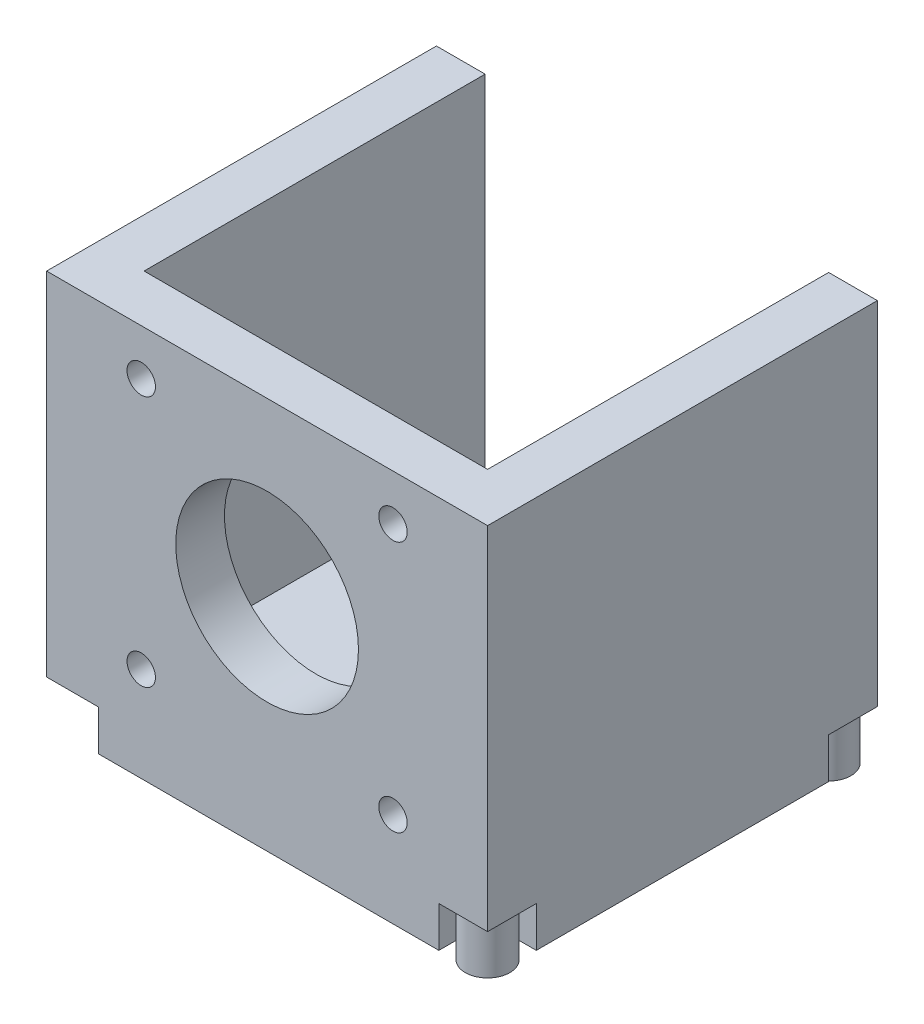
ISO-10303-21;
HEADER;
FILE_DESCRIPTION(('STEP AP214'),'2;1');
FILE_NAME('part.step','',(''),(''),'','','');
FILE_SCHEMA(('AUTOMOTIVE_DESIGN { 1 0 10303 214 1 1 1 1 }'));
ENDSEC;
DATA;
#1=APPLICATION_CONTEXT('core data for automotive mechanical design processes');
#2=APPLICATION_PROTOCOL_DEFINITION('international standard','automotive_design',2000,#1);
#3=PRODUCT_CONTEXT('',#1,'mechanical');
#4=PRODUCT('Part','Part','',(#3));
#5=PRODUCT_RELATED_PRODUCT_CATEGORY('part','',(#4));
#6=PRODUCT_DEFINITION_FORMATION('','',#4);
#7=PRODUCT_DEFINITION_CONTEXT('part definition',#1,'design');
#8=PRODUCT_DEFINITION('design','',#6,#7);
#9=PRODUCT_DEFINITION_SHAPE('','',#8);
#10=(LENGTH_UNIT() NAMED_UNIT(*) SI_UNIT(.MILLI.,.METRE.));
#11=(NAMED_UNIT(*) PLANE_ANGLE_UNIT() SI_UNIT($,.RADIAN.));
#12=(NAMED_UNIT(*) SI_UNIT($,.STERADIAN.) SOLID_ANGLE_UNIT());
#13=UNCERTAINTY_MEASURE_WITH_UNIT(LENGTH_MEASURE(1.E-05),#10,'distance_accuracy_value','');
#14=(GEOMETRIC_REPRESENTATION_CONTEXT(3) GLOBAL_UNCERTAINTY_ASSIGNED_CONTEXT((#13)) GLOBAL_UNIT_ASSIGNED_CONTEXT((#10,
#11,#12)) REPRESENTATION_CONTEXT('',''));
#15=CARTESIAN_POINT('',(0.,0.,0.));
#16=DIRECTION('',(0.,0.,1.));
#17=DIRECTION('',(1.,0.,0.));
#18=AXIS2_PLACEMENT_3D('',#15,#16,#17);
#19=CARTESIAN_POINT('',(0.,-1.,0.));
#20=DIRECTION('',(0.,-1.,0.));
#21=DIRECTION('',(0.,0.,-1.));
#22=AXIS2_PLACEMENT_3D('',#19,#20,#21);
#23=PLANE('',#22);
#24=DIRECTION('',(1.,0.,0.));
#25=VECTOR('',#24,1.);
#26=CARTESIAN_POINT('',(0.,-1.,-36.));
#27=LINE('',#26,#25);
#28=CARTESIAN_POINT('',(42.3,-1.,-36.));
#29=VERTEX_POINT('',#28);
#30=CARTESIAN_POINT('',(48.3,-1.,-36.));
#31=VERTEX_POINT('',#30);
#32=EDGE_CURVE('E255',#29,#31,#27,.T.);
#33=ORIENTED_EDGE('',*,*,#32,.F.);
#34=DIRECTION('',(0.,0.,1.));
#35=VECTOR('',#34,1.);
#36=CARTESIAN_POINT('',(42.3,-1.,0.));
#37=LINE('',#36,#35);
#38=CARTESIAN_POINT('',(42.3,-1.,-42.));
#39=VERTEX_POINT('',#38);
#40=EDGE_CURVE('E257',#39,#29,#37,.T.);
#41=ORIENTED_EDGE('',*,*,#40,.F.);
#42=DIRECTION('',(1.,0.,0.));
#43=VECTOR('',#42,1.);
#44=CARTESIAN_POINT('',(0.,-1.,-42.));
#45=LINE('',#44,#43);
#46=CARTESIAN_POINT('',(48.3,-1.,-42.));
#47=VERTEX_POINT('',#46);
#48=EDGE_CURVE('E260',#39,#47,#45,.T.);
#49=ORIENTED_EDGE('',*,*,#48,.T.);
#50=DIRECTION('',(0.,0.,1.));
#51=VECTOR('',#50,1.);
#52=CARTESIAN_POINT('',(48.3,-1.,0.));
#53=LINE('',#52,#51);
#54=EDGE_CURVE('E262',#47,#31,#53,.T.);
#55=ORIENTED_EDGE('',*,*,#54,.T.);
#56=EDGE_LOOP('',(#33,#41,#49,#55));
#57=FACE_BOUND('',#56,.T.);
#58=CARTESIAN_POINT('',(45.3,-1.,-39.));
#59=DIRECTION('',(0.,-1.,0.));
#60=DIRECTION('',(0.,0.,-1.));
#61=AXIS2_PLACEMENT_3D('',#58,#59,#60);
#62=CIRCLE('',#61,2.75);
#63=CARTESIAN_POINT('',(45.3,-1.,-41.75));
#64=VERTEX_POINT('',#63);
#65=EDGE_CURVE('E444',#64,#64,#62,.T.);
#66=ORIENTED_EDGE('',*,*,#65,.F.);
#67=EDGE_LOOP('',(#66));
#68=FACE_BOUND('',#67,.T.);
#69=ADVANCED_FACE('F35',(#57,#68),#23,.T.);
#70=CARTESIAN_POINT('',(0.,-1.,0.));
#71=DIRECTION('',(0.,-1.,0.));
#72=DIRECTION('',(0.,0.,-1.));
#73=AXIS2_PLACEMENT_3D('',#70,#71,#72);
#74=PLANE('',#73);
#75=DIRECTION('',(0.,0.,1.));
#76=VECTOR('',#75,1.);
#77=CARTESIAN_POINT('',(42.3,-1.,0.));
#78=LINE('',#77,#76);
#79=CARTESIAN_POINT('',(42.3,-1.,0.));
#80=VERTEX_POINT('',#79);
#81=CARTESIAN_POINT('',(42.3,-1.,6.));
#82=VERTEX_POINT('',#81);
#83=EDGE_CURVE('E184',#80,#82,#78,.T.);
#84=ORIENTED_EDGE('',*,*,#83,.F.);
#85=DIRECTION('',(-1.,0.,0.));
#86=VECTOR('',#85,1.);
#87=CARTESIAN_POINT('',(0.,-1.,0.));
#88=LINE('',#87,#86);
#89=CARTESIAN_POINT('',(48.3,-1.,0.));
#90=VERTEX_POINT('',#89);
#91=EDGE_CURVE('E176',#90,#80,#88,.T.);
#92=ORIENTED_EDGE('',*,*,#91,.F.);
#93=DIRECTION('',(0.,0.,1.));
#94=VECTOR('',#93,1.);
#95=CARTESIAN_POINT('',(48.3,-1.,0.));
#96=LINE('',#95,#94);
#97=CARTESIAN_POINT('',(48.3,-1.,6.));
#98=VERTEX_POINT('',#97);
#99=EDGE_CURVE('E52',#90,#98,#96,.T.);
#100=ORIENTED_EDGE('',*,*,#99,.T.);
#101=DIRECTION('',(-1.,0.,0.));
#102=VECTOR('',#101,1.);
#103=CARTESIAN_POINT('',(0.,-1.,6.));
#104=LINE('',#103,#102);
#105=EDGE_CURVE('E191',#98,#82,#104,.T.);
#106=ORIENTED_EDGE('',*,*,#105,.T.);
#107=EDGE_LOOP('',(#84,#92,#100,#106));
#108=FACE_BOUND('',#107,.T.);
#109=CARTESIAN_POINT('',(45.3,-1.,3.));
#110=DIRECTION('',(0.,-1.,0.));
#111=DIRECTION('',(0.,0.,-1.));
#112=AXIS2_PLACEMENT_3D('',#109,#110,#111);
#113=CIRCLE('',#112,2.75);
#114=CARTESIAN_POINT('',(45.3,-1.,0.249999999999999));
#115=VERTEX_POINT('',#114);
#116=EDGE_CURVE('E200',#115,#115,#113,.T.);
#117=ORIENTED_EDGE('',*,*,#116,.F.);
#118=EDGE_LOOP('',(#117));
#119=FACE_BOUND('',#118,.T.);
#120=ADVANCED_FACE('F193',(#108,#119),#74,.T.);
#121=CARTESIAN_POINT('',(48.3,0.,0.));
#122=DIRECTION('',(-1.,0.,0.));
#123=DIRECTION('',(0.,0.,1.));
#124=AXIS2_PLACEMENT_3D('',#121,#122,#123);
#125=PLANE('',#124);
#126=DIRECTION('',(0.,-1.,0.));
#127=VECTOR('',#126,1.);
#128=CARTESIAN_POINT('',(48.3,-1.,0.));
#129=LINE('',#128,#127);
#130=CARTESIAN_POINT('',(48.3,-6.,0.));
#131=VERTEX_POINT('',#130);
#132=EDGE_CURVE('E182',#90,#131,#129,.T.);
#133=ORIENTED_EDGE('',*,*,#132,.T.);
#134=DIRECTION('',(0.,0.,1.));
#135=VECTOR('',#134,1.);
#136=CARTESIAN_POINT('',(48.3,-6.,-42.));
#137=LINE('',#136,#135);
#138=CARTESIAN_POINT('',(48.3,-6.,-36.));
#139=VERTEX_POINT('',#138);
#140=EDGE_CURVE('E282',#139,#131,#137,.T.);
#141=ORIENTED_EDGE('',*,*,#140,.F.);
#142=DIRECTION('',(0.,-1.,0.));
#143=VECTOR('',#142,1.);
#144=CARTESIAN_POINT('',(48.3,-1.,-36.));
#145=LINE('',#144,#143);
#146=EDGE_CURVE('E270',#31,#139,#145,.T.);
#147=ORIENTED_EDGE('',*,*,#146,.F.);
#148=ORIENTED_EDGE('',*,*,#54,.F.);
#149=DIRECTION('',(0.,1.,0.));
#150=VECTOR('',#149,1.);
#151=CARTESIAN_POINT('',(48.3,42.3,-42.));
#152=LINE('',#151,#150);
#153=CARTESIAN_POINT('',(48.3,42.3,-42.));
#154=VERTEX_POINT('',#153);
#155=EDGE_CURVE('E295',#47,#154,#152,.T.);
#156=ORIENTED_EDGE('',*,*,#155,.T.);
#157=DIRECTION('',(0.,0.,1.));
#158=VECTOR('',#157,1.);
#159=CARTESIAN_POINT('',(48.3,42.3,6.));
#160=LINE('',#159,#158);
#161=CARTESIAN_POINT('',(48.3,42.3,6.));
#162=VERTEX_POINT('',#161);
#163=EDGE_CURVE('E298',#154,#162,#160,.T.);
#164=ORIENTED_EDGE('',*,*,#163,.T.);
#165=DIRECTION('',(0.,-1.,0.));
#166=VECTOR('',#165,1.);
#167=CARTESIAN_POINT('',(48.3,0.,6.));
#168=LINE('',#167,#166);
#169=EDGE_CURVE('E292',#162,#98,#168,.T.);
#170=ORIENTED_EDGE('',*,*,#169,.T.);
#171=ORIENTED_EDGE('',*,*,#99,.F.);
#172=EDGE_LOOP('',(#133,#141,#147,#148,#156,#164,#170,#171));
#173=FACE_BOUND('',#172,.T.);
#174=ADVANCED_FACE('F418',(#173),#125,.F.);
#175=CARTESIAN_POINT('',(0.,-6.,0.));
#176=DIRECTION('',(0.,-1.,0.));
#177=DIRECTION('',(0.,0.,-1.));
#178=AXIS2_PLACEMENT_3D('',#175,#176,#177);
#179=PLANE('',#178);
#180=DIRECTION('',(-1.,0.,0.));
#181=VECTOR('',#180,1.);
#182=CARTESIAN_POINT('',(0.,-6.,0.));
#183=LINE('',#182,#181);
#184=CARTESIAN_POINT('',(42.3,-6.,0.));
#185=VERTEX_POINT('',#184);
#186=EDGE_CURVE('E196',#131,#185,#183,.T.);
#187=ORIENTED_EDGE('',*,*,#186,.T.);
#188=DIRECTION('',(0.,0.,1.));
#189=VECTOR('',#188,1.);
#190=CARTESIAN_POINT('',(42.3,-6.,0.));
#191=LINE('',#190,#189);
#192=CARTESIAN_POINT('',(42.3,-6.,6.));
#193=VERTEX_POINT('',#192);
#194=EDGE_CURVE('E189',#185,#193,#191,.T.);
#195=ORIENTED_EDGE('',*,*,#194,.T.);
#196=DIRECTION('',(-1.,0.,0.));
#197=VECTOR('',#196,1.);
#198=CARTESIAN_POINT('',(48.3,-6.,6.));
#199=LINE('',#198,#197);
#200=CARTESIAN_POINT('',(0.359997753687231,-6.,6.));
#201=VERTEX_POINT('',#200);
#202=EDGE_CURVE('E285',#193,#201,#199,.T.);
#203=ORIENTED_EDGE('',*,*,#202,.T.);
#204=DIRECTION('',(0.,0.,1.));
#205=VECTOR('',#204,1.);
#206=CARTESIAN_POINT('',(0.359997753687231,-6.,0.));
#207=LINE('',#206,#205);
#208=CARTESIAN_POINT('',(0.359997753687231,-6.,0.));
#209=VERTEX_POINT('',#208);
#210=EDGE_CURVE('E215',#209,#201,#207,.T.);
#211=ORIENTED_EDGE('',*,*,#210,.F.);
#212=DIRECTION('',(1.,0.,0.));
#213=VECTOR('',#212,1.);
#214=CARTESIAN_POINT('',(0.,-6.,0.));
#215=LINE('',#214,#213);
#216=CARTESIAN_POINT('',(-6.,-6.,0.));
#217=VERTEX_POINT('',#216);
#218=EDGE_CURVE('E209',#217,#209,#215,.T.);
#219=ORIENTED_EDGE('',*,*,#218,.F.);
#220=DIRECTION('',(0.,0.,-1.));
#221=VECTOR('',#220,1.);
#222=CARTESIAN_POINT('',(-6.,-6.,6.));
#223=LINE('',#222,#221);
#224=CARTESIAN_POINT('',(-6.,-6.,-36.));
#225=VERTEX_POINT('',#224);
#226=EDGE_CURVE('E278',#217,#225,#223,.T.);
#227=ORIENTED_EDGE('',*,*,#226,.T.);
#228=DIRECTION('',(-1.,0.,0.));
#229=VECTOR('',#228,1.);
#230=CARTESIAN_POINT('',(0.,-6.,-36.));
#231=LINE('',#230,#229);
#232=CARTESIAN_POINT('',(0.,-6.,-36.));
#233=VERTEX_POINT('',#232);
#234=EDGE_CURVE('E236',#233,#225,#231,.T.);
#235=ORIENTED_EDGE('',*,*,#234,.F.);
#236=DIRECTION('',(0.,0.,1.));
#237=VECTOR('',#236,1.);
#238=CARTESIAN_POINT('',(0.,-6.,0.));
#239=LINE('',#238,#237);
#240=CARTESIAN_POINT('',(0.,-6.,-42.));
#241=VERTEX_POINT('',#240);
#242=EDGE_CURVE('E227',#241,#233,#239,.T.);
#243=ORIENTED_EDGE('',*,*,#242,.F.);
#244=DIRECTION('',(1.,0.,0.));
#245=VECTOR('',#244,1.);
#246=CARTESIAN_POINT('',(-6.,-6.,-42.));
#247=LINE('',#246,#245);
#248=CARTESIAN_POINT('',(42.3,-6.,-42.));
#249=VERTEX_POINT('',#248);
#250=EDGE_CURVE('E280',#241,#249,#247,.T.);
#251=ORIENTED_EDGE('',*,*,#250,.T.);
#252=DIRECTION('',(0.,0.,1.));
#253=VECTOR('',#252,1.);
#254=CARTESIAN_POINT('',(42.3,-6.,0.));
#255=LINE('',#254,#253);
#256=CARTESIAN_POINT('',(42.3,-6.,-36.));
#257=VERTEX_POINT('',#256);
#258=EDGE_CURVE('E258',#249,#257,#255,.T.);
#259=ORIENTED_EDGE('',*,*,#258,.T.);
#260=DIRECTION('',(1.,0.,0.));
#261=VECTOR('',#260,1.);
#262=CARTESIAN_POINT('',(0.,-6.,-36.));
#263=LINE('',#262,#261);
#264=EDGE_CURVE('E250',#257,#139,#263,.T.);
#265=ORIENTED_EDGE('',*,*,#264,.T.);
#266=ORIENTED_EDGE('',*,*,#140,.T.);
#267=EDGE_LOOP('',(#187,#195,#203,#211,#219,#227,#235,#243,#251,#259,#265,#266));
#268=FACE_BOUND('',#267,.T.);
#269=ADVANCED_FACE('F424',(#268),#179,.T.);
#270=CARTESIAN_POINT('',(0.,0.,6.));
#271=DIRECTION('',(0.,0.,-1.));
#272=DIRECTION('',(-1.,0.,0.));
#273=AXIS2_PLACEMENT_3D('',#270,#271,#272);
#274=PLANE('',#273);
#275=CARTESIAN_POINT('',(36.6500000000003,5.65,6.));
#276=DIRECTION('',(0.,0.,1.));
#277=DIRECTION('',(1.,0.,0.));
#278=AXIS2_PLACEMENT_3D('',#275,#276,#277);
#279=CIRCLE('',#278,1.75);
#280=CARTESIAN_POINT('',(38.4000000000003,5.65,6.));
#281=VERTEX_POINT('',#280);
#282=EDGE_CURVE('E329',#281,#281,#279,.T.);
#283=ORIENTED_EDGE('',*,*,#282,.F.);
#284=EDGE_LOOP('',(#283));
#285=FACE_BOUND('',#284,.T.);
#286=CARTESIAN_POINT('',(5.65,36.6499999999998,6.));
#287=DIRECTION('',(0.,0.,1.));
#288=DIRECTION('',(1.,0.,0.));
#289=AXIS2_PLACEMENT_3D('',#286,#287,#288);
#290=CIRCLE('',#289,1.75);
#291=CARTESIAN_POINT('',(7.40000000000001,36.6499999999998,6.));
#292=VERTEX_POINT('',#291);
#293=EDGE_CURVE('E342',#292,#292,#290,.T.);
#294=ORIENTED_EDGE('',*,*,#293,.F.);
#295=EDGE_LOOP('',(#294));
#296=FACE_BOUND('',#295,.T.);
#297=CARTESIAN_POINT('',(36.65,36.65,6.));
#298=DIRECTION('',(0.,0.,1.));
#299=DIRECTION('',(1.,0.,0.));
#300=AXIS2_PLACEMENT_3D('',#297,#298,#299);
#301=CIRCLE('',#300,1.75);
#302=CARTESIAN_POINT('',(38.4,36.65,6.));
#303=VERTEX_POINT('',#302);
#304=EDGE_CURVE('E354',#303,#303,#301,.T.);
#305=ORIENTED_EDGE('',*,*,#304,.F.);
#306=EDGE_LOOP('',(#305));
#307=FACE_BOUND('',#306,.T.);
#308=CARTESIAN_POINT('',(21.15,21.15,6.));
#309=DIRECTION('',(0.,0.,1.));
#310=DIRECTION('',(1.,0.,0.));
#311=AXIS2_PLACEMENT_3D('',#308,#309,#310);
#312=CIRCLE('',#311,11.25);
#313=CARTESIAN_POINT('',(32.4,21.15,6.));
#314=VERTEX_POINT('',#313);
#315=EDGE_CURVE('E348',#314,#314,#312,.T.);
#316=ORIENTED_EDGE('',*,*,#315,.F.);
#317=EDGE_LOOP('',(#316));
#318=FACE_BOUND('',#317,.T.);
#319=CARTESIAN_POINT('',(5.65000000000033,5.64999999999979,6.));
#320=DIRECTION('',(0.,0.,1.));
#321=DIRECTION('',(1.,0.,0.));
#322=AXIS2_PLACEMENT_3D('',#319,#320,#321);
#323=CIRCLE('',#322,1.75);
#324=CARTESIAN_POINT('',(7.40000000000033,5.64999999999979,6.));
#325=VERTEX_POINT('',#324);
#326=EDGE_CURVE('E336',#325,#325,#323,.T.);
#327=ORIENTED_EDGE('',*,*,#326,.F.);
#328=EDGE_LOOP('',(#327));
#329=FACE_BOUND('',#328,.T.);
#330=DIRECTION('',(0.,-1.,0.));
#331=VECTOR('',#330,1.);
#332=CARTESIAN_POINT('',(42.3,-1.,6.));
#333=LINE('',#332,#331);
#334=EDGE_CURVE('E207',#82,#193,#333,.T.);
#335=ORIENTED_EDGE('',*,*,#334,.F.);
#336=ORIENTED_EDGE('',*,*,#105,.F.);
#337=ORIENTED_EDGE('',*,*,#169,.F.);
#338=DIRECTION('',(-1.,0.,0.));
#339=VECTOR('',#338,1.);
#340=CARTESIAN_POINT('',(42.3,42.3,6.));
#341=LINE('',#340,#339);
#342=CARTESIAN_POINT('',(-6.,42.3,6.));
#343=VERTEX_POINT('',#342);
#344=EDGE_CURVE('E11',#162,#343,#341,.T.);
#345=ORIENTED_EDGE('',*,*,#344,.T.);
#346=DIRECTION('',(0.,1.,0.));
#347=VECTOR('',#346,1.);
#348=CARTESIAN_POINT('',(-6.,0.,6.));
#349=LINE('',#348,#347);
#350=CARTESIAN_POINT('',(-6.,-1.,6.));
#351=VERTEX_POINT('',#350);
#352=EDGE_CURVE('E311',#351,#343,#349,.T.);
#353=ORIENTED_EDGE('',*,*,#352,.F.);
#354=DIRECTION('',(-1.,0.,0.));
#355=VECTOR('',#354,1.);
#356=CARTESIAN_POINT('',(0.,-1.,6.));
#357=LINE('',#356,#355);
#358=CARTESIAN_POINT('',(0.359997753687231,-1.,6.));
#359=VERTEX_POINT('',#358);
#360=EDGE_CURVE('E60',#359,#351,#357,.T.);
#361=ORIENTED_EDGE('',*,*,#360,.F.);
#362=DIRECTION('',(0.,-1.,0.));
#363=VECTOR('',#362,1.);
#364=CARTESIAN_POINT('',(0.359997753687231,-1.,6.));
#365=LINE('',#364,#363);
#366=EDGE_CURVE('E228',#359,#201,#365,.T.);
#367=ORIENTED_EDGE('',*,*,#366,.T.);
#368=ORIENTED_EDGE('',*,*,#202,.F.);
#369=EDGE_LOOP('',(#335,#336,#337,#345,#353,#361,#367,#368));
#370=FACE_BOUND('',#369,.T.);
#371=ADVANCED_FACE('F421',(#285,#296,#307,#318,#329,#370),#274,.F.);
#372=CARTESIAN_POINT('',(-6.,42.3,-42.));
#373=DIRECTION('',(0.,0.,1.));
#374=DIRECTION('',(0.,-1.,0.));
#375=AXIS2_PLACEMENT_3D('',#372,#373,#374);
#376=PLANE('',#375);
#377=ORIENTED_EDGE('',*,*,#250,.F.);
#378=DIRECTION('',(0.,-1.,0.));
#379=VECTOR('',#378,1.);
#380=CARTESIAN_POINT('',(0.,-1.,-42.));
#381=LINE('',#380,#379);
#382=CARTESIAN_POINT('',(0.,-1.,-42.));
#383=VERTEX_POINT('',#382);
#384=EDGE_CURVE('E248',#383,#241,#381,.T.);
#385=ORIENTED_EDGE('',*,*,#384,.F.);
#386=DIRECTION('',(1.,0.,0.));
#387=VECTOR('',#386,1.);
#388=CARTESIAN_POINT('',(0.,-1.,-42.));
#389=LINE('',#388,#387);
#390=CARTESIAN_POINT('',(-6.,-1.,-42.));
#391=VERTEX_POINT('',#390);
#392=EDGE_CURVE('E240',#391,#383,#389,.T.);
#393=ORIENTED_EDGE('',*,*,#392,.F.);
#394=DIRECTION('',(0.,-1.,0.));
#395=VECTOR('',#394,1.);
#396=CARTESIAN_POINT('',(-6.,42.3,-42.));
#397=LINE('',#396,#395);
#398=CARTESIAN_POINT('',(-6.,42.3,-42.));
#399=VERTEX_POINT('',#398);
#400=EDGE_CURVE('E316',#399,#391,#397,.T.);
#401=ORIENTED_EDGE('',*,*,#400,.F.);
#402=DIRECTION('',(1.,0.,0.));
#403=VECTOR('',#402,1.);
#404=CARTESIAN_POINT('',(-6.,42.3,-42.));
#405=LINE('',#404,#403);
#406=CARTESIAN_POINT('',(0.,42.3,-42.));
#407=VERTEX_POINT('',#406);
#408=EDGE_CURVE('E319',#399,#407,#405,.T.);
#409=ORIENTED_EDGE('',*,*,#408,.T.);
#410=DIRECTION('',(0.,-1.,0.));
#411=VECTOR('',#410,1.);
#412=CARTESIAN_POINT('',(0.,42.3,-42.));
#413=LINE('',#412,#411);
#414=CARTESIAN_POINT('',(0.,0.,-42.));
#415=VERTEX_POINT('',#414);
#416=EDGE_CURVE('E328',#407,#415,#413,.T.);
#417=ORIENTED_EDGE('',*,*,#416,.T.);
#418=DIRECTION('',(1.,0.,0.));
#419=VECTOR('',#418,1.);
#420=CARTESIAN_POINT('',(-6.,0.,-42.));
#421=LINE('',#420,#419);
#422=CARTESIAN_POINT('',(42.3,0.,-42.));
#423=VERTEX_POINT('',#422);
#424=EDGE_CURVE('E272',#415,#423,#421,.T.);
#425=ORIENTED_EDGE('',*,*,#424,.T.);
#426=DIRECTION('',(0.,1.,0.));
#427=VECTOR('',#426,1.);
#428=CARTESIAN_POINT('',(42.3,42.3,-42.));
#429=LINE('',#428,#427);
#430=CARTESIAN_POINT('',(42.3,42.3,-42.));
#431=VERTEX_POINT('',#430);
#432=EDGE_CURVE('E310',#423,#431,#429,.T.);
#433=ORIENTED_EDGE('',*,*,#432,.T.);
#434=DIRECTION('',(-1.,0.,0.));
#435=VECTOR('',#434,1.);
#436=CARTESIAN_POINT('',(48.3,42.3,-42.));
#437=LINE('',#436,#435);
#438=EDGE_CURVE('E301',#154,#431,#437,.T.);
#439=ORIENTED_EDGE('',*,*,#438,.F.);
#440=ORIENTED_EDGE('',*,*,#155,.F.);
#441=ORIENTED_EDGE('',*,*,#48,.F.);
#442=DIRECTION('',(0.,-1.,0.));
#443=VECTOR('',#442,1.);
#444=CARTESIAN_POINT('',(42.3,-1.,-42.));
#445=LINE('',#444,#443);
#446=EDGE_CURVE('E273',#39,#249,#445,.T.);
#447=ORIENTED_EDGE('',*,*,#446,.T.);
#448=EDGE_LOOP('',(#377,#385,#393,#401,#409,#417,#425,#433,#439,#440,#441,#447));
#449=FACE_BOUND('',#448,.T.);
#450=ADVANCED_FACE('F407',(#449),#376,.F.);
#451=CARTESIAN_POINT('',(0.,0.,0.));
#452=DIRECTION('',(0.,0.,-1.));
#453=DIRECTION('',(-1.,0.,0.));
#454=AXIS2_PLACEMENT_3D('',#451,#452,#453);
#455=PLANE('',#454);
#456=CARTESIAN_POINT('',(5.65000000000033,5.64999999999979,0.));
#457=DIRECTION('',(0.,0.,1.));
#458=DIRECTION('',(1.,0.,0.));
#459=AXIS2_PLACEMENT_3D('',#456,#457,#458);
#460=CIRCLE('',#459,1.75);
#461=CARTESIAN_POINT('',(7.40000000000033,5.64999999999979,0.));
#462=VERTEX_POINT('',#461);
#463=EDGE_CURVE('E332',#462,#462,#460,.T.);
#464=ORIENTED_EDGE('',*,*,#463,.T.);
#465=EDGE_LOOP('',(#464));
#466=FACE_BOUND('',#465,.T.);
#467=CARTESIAN_POINT('',(21.15,21.15,0.));
#468=DIRECTION('',(0.,0.,1.));
#469=DIRECTION('',(1.,0.,0.));
#470=AXIS2_PLACEMENT_3D('',#467,#468,#469);
#471=CIRCLE('',#470,11.25);
#472=CARTESIAN_POINT('',(32.4,21.15,0.));
#473=VERTEX_POINT('',#472);
#474=EDGE_CURVE('E345',#473,#473,#471,.T.);
#475=ORIENTED_EDGE('',*,*,#474,.T.);
#476=EDGE_LOOP('',(#475));
#477=FACE_BOUND('',#476,.T.);
#478=DIRECTION('',(0.,1.,0.));
#479=VECTOR('',#478,1.);
#480=CARTESIAN_POINT('',(42.3,42.3,0.));
#481=LINE('',#480,#479);
#482=CARTESIAN_POINT('',(42.3,0.,0.));
#483=VERTEX_POINT('',#482);
#484=CARTESIAN_POINT('',(42.3,42.3,0.));
#485=VERTEX_POINT('',#484);
#486=EDGE_CURVE('E357',#483,#485,#481,.T.);
#487=ORIENTED_EDGE('',*,*,#486,.F.);
#488=DIRECTION('',(1.,0.,0.));
#489=VECTOR('',#488,1.);
#490=CARTESIAN_POINT('',(42.3,0.,0.));
#491=LINE('',#490,#489);
#492=CARTESIAN_POINT('',(0.,0.,0.));
#493=VERTEX_POINT('',#492);
#494=EDGE_CURVE('E44',#493,#483,#491,.T.);
#495=ORIENTED_EDGE('',*,*,#494,.F.);
#496=DIRECTION('',(0.,-1.,0.));
#497=VECTOR('',#496,1.);
#498=CARTESIAN_POINT('',(0.,42.3,0.));
#499=LINE('',#498,#497);
#500=CARTESIAN_POINT('',(0.,42.3,0.));
#501=VERTEX_POINT('',#500);
#502=EDGE_CURVE('E390',#501,#493,#499,.T.);
#503=ORIENTED_EDGE('',*,*,#502,.F.);
#504=DIRECTION('',(-1.,0.,0.));
#505=VECTOR('',#504,1.);
#506=CARTESIAN_POINT('',(42.3,42.3,0.));
#507=LINE('',#506,#505);
#508=EDGE_CURVE('E368',#485,#501,#507,.T.);
#509=ORIENTED_EDGE('',*,*,#508,.F.);
#510=EDGE_LOOP('',(#487,#495,#503,#509));
#511=FACE_BOUND('',#510,.T.);
#512=CARTESIAN_POINT('',(36.65,36.65,0.));
#513=DIRECTION('',(0.,0.,1.));
#514=DIRECTION('',(1.,0.,0.));
#515=AXIS2_PLACEMENT_3D('',#512,#513,#514);
#516=CIRCLE('',#515,1.75);
#517=CARTESIAN_POINT('',(38.4,36.65,0.));
#518=VERTEX_POINT('',#517);
#519=EDGE_CURVE('E351',#518,#518,#516,.T.);
#520=ORIENTED_EDGE('',*,*,#519,.T.);
#521=EDGE_LOOP('',(#520));
#522=FACE_BOUND('',#521,.T.);
#523=CARTESIAN_POINT('',(5.65,36.6499999999998,0.));
#524=DIRECTION('',(0.,0.,1.));
#525=DIRECTION('',(1.,0.,0.));
#526=AXIS2_PLACEMENT_3D('',#523,#524,#525);
#527=CIRCLE('',#526,1.75);
#528=CARTESIAN_POINT('',(7.40000000000001,36.6499999999998,0.));
#529=VERTEX_POINT('',#528);
#530=EDGE_CURVE('E339',#529,#529,#527,.T.);
#531=ORIENTED_EDGE('',*,*,#530,.T.);
#532=EDGE_LOOP('',(#531));
#533=FACE_BOUND('',#532,.T.);
#534=CARTESIAN_POINT('',(36.6500000000003,5.65,0.));
#535=DIRECTION('',(0.,0.,1.));
#536=DIRECTION('',(1.,0.,0.));
#537=AXIS2_PLACEMENT_3D('',#534,#535,#536);
#538=CIRCLE('',#537,1.75);
#539=CARTESIAN_POINT('',(38.4000000000003,5.65,0.));
#540=VERTEX_POINT('',#539);
#541=EDGE_CURVE('E333',#540,#540,#538,.T.);
#542=ORIENTED_EDGE('',*,*,#541,.T.);
#543=EDGE_LOOP('',(#542));
#544=FACE_BOUND('',#543,.T.);
#545=ADVANCED_FACE('F387',(#466,#477,#511,#522,#533,#544),#455,.T.);
#546=CARTESIAN_POINT('',(42.3,42.3,6.));
#547=DIRECTION('',(0.,-1.,0.));
#548=DIRECTION('',(1.,0.,0.));
#549=AXIS2_PLACEMENT_3D('',#546,#547,#548);
#550=PLANE('',#549);
#551=ORIENTED_EDGE('',*,*,#508,.T.);
#552=DIRECTION('',(0.,0.,-1.));
#553=VECTOR('',#552,1.);
#554=CARTESIAN_POINT('',(0.,42.3,6.));
#555=LINE('',#554,#553);
#556=EDGE_CURVE('E325',#501,#407,#555,.T.);
#557=ORIENTED_EDGE('',*,*,#556,.T.);
#558=ORIENTED_EDGE('',*,*,#408,.F.);
#559=DIRECTION('',(0.,0.,-1.));
#560=VECTOR('',#559,1.);
#561=CARTESIAN_POINT('',(-6.,42.3,6.));
#562=LINE('',#561,#560);
#563=EDGE_CURVE('E313',#343,#399,#562,.T.);
#564=ORIENTED_EDGE('',*,*,#563,.F.);
#565=ORIENTED_EDGE('',*,*,#344,.F.);
#566=ORIENTED_EDGE('',*,*,#163,.F.);
#567=ORIENTED_EDGE('',*,*,#438,.T.);
#568=DIRECTION('',(0.,0.,1.));
#569=VECTOR('',#568,1.);
#570=CARTESIAN_POINT('',(42.3,42.3,6.));
#571=LINE('',#570,#569);
#572=EDGE_CURVE('E296',#431,#485,#571,.T.);
#573=ORIENTED_EDGE('',*,*,#572,.T.);
#574=EDGE_LOOP('',(#551,#557,#558,#564,#565,#566,#567,#573));
#575=FACE_BOUND('',#574,.T.);
#576=ADVANCED_FACE('F37',(#575),#550,.F.);
#577=CARTESIAN_POINT('',(36.65,36.65,6.));
#578=DIRECTION('',(0.,0.,-1.));
#579=DIRECTION('',(-1.,0.,0.));
#580=AXIS2_PLACEMENT_3D('',#577,#578,#579);
#581=CYLINDRICAL_SURFACE('',#580,1.75);
#582=ORIENTED_EDGE('',*,*,#304,.T.);
#583=EDGE_LOOP('',(#582));
#584=FACE_BOUND('',#583,.T.);
#585=ORIENTED_EDGE('',*,*,#519,.F.);
#586=EDGE_LOOP('',(#585));
#587=FACE_BOUND('',#586,.T.);
#588=ADVANCED_FACE('F524',(#584,#587),#581,.F.);
#589=CARTESIAN_POINT('',(21.15,21.15,6.));
#590=DIRECTION('',(0.,0.,-1.));
#591=DIRECTION('',(-1.,0.,0.));
#592=AXIS2_PLACEMENT_3D('',#589,#590,#591);
#593=CYLINDRICAL_SURFACE('',#592,11.25);
#594=ORIENTED_EDGE('',*,*,#315,.T.);
#595=EDGE_LOOP('',(#594));
#596=FACE_BOUND('',#595,.T.);
#597=ORIENTED_EDGE('',*,*,#474,.F.);
#598=EDGE_LOOP('',(#597));
#599=FACE_BOUND('',#598,.T.);
#600=ADVANCED_FACE('F520',(#596,#599),#593,.F.);
#601=CARTESIAN_POINT('',(5.65,36.6499999999998,6.));
#602=DIRECTION('',(0.,0.,-1.));
#603=DIRECTION('',(-1.,0.,0.));
#604=AXIS2_PLACEMENT_3D('',#601,#602,#603);
#605=CYLINDRICAL_SURFACE('',#604,1.75);
#606=ORIENTED_EDGE('',*,*,#293,.T.);
#607=EDGE_LOOP('',(#606));
#608=FACE_BOUND('',#607,.T.);
#609=ORIENTED_EDGE('',*,*,#530,.F.);
#610=EDGE_LOOP('',(#609));
#611=FACE_BOUND('',#610,.T.);
#612=ADVANCED_FACE('F516',(#608,#611),#605,.F.);
#613=CARTESIAN_POINT('',(5.65000000000033,5.64999999999979,6.));
#614=DIRECTION('',(0.,0.,-1.));
#615=DIRECTION('',(-1.,0.,0.));
#616=AXIS2_PLACEMENT_3D('',#613,#614,#615);
#617=CYLINDRICAL_SURFACE('',#616,1.75);
#618=ORIENTED_EDGE('',*,*,#326,.T.);
#619=EDGE_LOOP('',(#618));
#620=FACE_BOUND('',#619,.T.);
#621=ORIENTED_EDGE('',*,*,#463,.F.);
#622=EDGE_LOOP('',(#621));
#623=FACE_BOUND('',#622,.T.);
#624=ADVANCED_FACE('F512',(#620,#623),#617,.F.);
#625=CARTESIAN_POINT('',(36.6500000000003,5.65,6.));
#626=DIRECTION('',(0.,0.,-1.));
#627=DIRECTION('',(-1.,0.,0.));
#628=AXIS2_PLACEMENT_3D('',#625,#626,#627);
#629=CYLINDRICAL_SURFACE('',#628,1.75);
#630=ORIENTED_EDGE('',*,*,#282,.T.);
#631=EDGE_LOOP('',(#630));
#632=FACE_BOUND('',#631,.T.);
#633=ORIENTED_EDGE('',*,*,#541,.F.);
#634=EDGE_LOOP('',(#633));
#635=FACE_BOUND('',#634,.T.);
#636=ADVANCED_FACE('F507',(#632,#635),#629,.F.);
#637=CARTESIAN_POINT('',(0.,0.,0.));
#638=DIRECTION('',(-1.,0.,0.));
#639=DIRECTION('',(0.,-1.,0.));
#640=AXIS2_PLACEMENT_3D('',#637,#638,#639);
#641=PLANE('',#640);
#642=ORIENTED_EDGE('',*,*,#556,.F.);
#643=ORIENTED_EDGE('',*,*,#502,.T.);
#644=DIRECTION('',(0.,0.,1.));
#645=VECTOR('',#644,1.);
#646=CARTESIAN_POINT('',(0.,0.,-42.));
#647=LINE('',#646,#645);
#648=EDGE_CURVE('E314',#415,#493,#647,.T.);
#649=ORIENTED_EDGE('',*,*,#648,.F.);
#650=ORIENTED_EDGE('',*,*,#416,.F.);
#651=EDGE_LOOP('',(#642,#643,#649,#650));
#652=FACE_BOUND('',#651,.T.);
#653=ADVANCED_FACE('F401',(#652),#641,.F.);
#654=CARTESIAN_POINT('',(-6.,0.,0.));
#655=DIRECTION('',(-1.,0.,0.));
#656=DIRECTION('',(0.,-1.,0.));
#657=AXIS2_PLACEMENT_3D('',#654,#655,#656);
#658=PLANE('',#657);
#659=DIRECTION('',(0.,-1.,0.));
#660=VECTOR('',#659,1.);
#661=CARTESIAN_POINT('',(-6.,-1.,0.));
#662=LINE('',#661,#660);
#663=CARTESIAN_POINT('',(-6.,-1.,0.));
#664=VERTEX_POINT('',#663);
#665=EDGE_CURVE('E225',#664,#217,#662,.T.);
#666=ORIENTED_EDGE('',*,*,#665,.F.);
#667=DIRECTION('',(0.,0.,-1.));
#668=VECTOR('',#667,1.);
#669=CARTESIAN_POINT('',(-6.,-1.,0.));
#670=LINE('',#669,#668);
#671=EDGE_CURVE('E218',#351,#664,#670,.T.);
#672=ORIENTED_EDGE('',*,*,#671,.F.);
#673=ORIENTED_EDGE('',*,*,#352,.T.);
#674=ORIENTED_EDGE('',*,*,#563,.T.);
#675=ORIENTED_EDGE('',*,*,#400,.T.);
#676=DIRECTION('',(0.,0.,-1.));
#677=VECTOR('',#676,1.);
#678=CARTESIAN_POINT('',(-6.,-1.,0.));
#679=LINE('',#678,#677);
#680=CARTESIAN_POINT('',(-6.,-1.,-36.));
#681=VERTEX_POINT('',#680);
#682=EDGE_CURVE('E238',#681,#391,#679,.T.);
#683=ORIENTED_EDGE('',*,*,#682,.F.);
#684=DIRECTION('',(0.,-1.,0.));
#685=VECTOR('',#684,1.);
#686=CARTESIAN_POINT('',(-6.,-1.,-36.));
#687=LINE('',#686,#685);
#688=EDGE_CURVE('E251',#681,#225,#687,.T.);
#689=ORIENTED_EDGE('',*,*,#688,.T.);
#690=ORIENTED_EDGE('',*,*,#226,.F.);
#691=EDGE_LOOP('',(#666,#672,#673,#674,#675,#683,#689,#690));
#692=FACE_BOUND('',#691,.T.);
#693=ADVANCED_FACE('F413',(#692),#658,.T.);
#694=CARTESIAN_POINT('',(42.3,0.,0.));
#695=DIRECTION('',(-1.,0.,0.));
#696=DIRECTION('',(0.,0.,1.));
#697=AXIS2_PLACEMENT_3D('',#694,#695,#696);
#698=PLANE('',#697);
#699=DIRECTION('',(0.,0.,-1.));
#700=VECTOR('',#699,1.);
#701=CARTESIAN_POINT('',(42.3,0.,-42.));
#702=LINE('',#701,#700);
#703=EDGE_CURVE('E287',#483,#423,#702,.T.);
#704=ORIENTED_EDGE('',*,*,#703,.F.);
#705=ORIENTED_EDGE('',*,*,#486,.T.);
#706=ORIENTED_EDGE('',*,*,#572,.F.);
#707=ORIENTED_EDGE('',*,*,#432,.F.);
#708=EDGE_LOOP('',(#704,#705,#706,#707));
#709=FACE_BOUND('',#708,.T.);
#710=ADVANCED_FACE('F383',(#709),#698,.T.);
#711=CARTESIAN_POINT('',(0.,0.,0.));
#712=DIRECTION('',(0.,-1.,0.));
#713=DIRECTION('',(0.,0.,-1.));
#714=AXIS2_PLACEMENT_3D('',#711,#712,#713);
#715=PLANE('',#714);
#716=ORIENTED_EDGE('',*,*,#494,.T.);
#717=ORIENTED_EDGE('',*,*,#703,.T.);
#718=ORIENTED_EDGE('',*,*,#424,.F.);
#719=ORIENTED_EDGE('',*,*,#648,.T.);
#720=EDGE_LOOP('',(#716,#717,#718,#719));
#721=FACE_BOUND('',#720,.T.);
#722=ADVANCED_FACE('F396',(#721),#715,.F.);
#723=CARTESIAN_POINT('',(0.,-1.,-36.));
#724=DIRECTION('',(0.,0.,-1.));
#725=DIRECTION('',(-1.,0.,0.));
#726=AXIS2_PLACEMENT_3D('',#723,#724,#725);
#727=PLANE('',#726);
#728=ORIENTED_EDGE('',*,*,#264,.F.);
#729=DIRECTION('',(0.,-1.,0.));
#730=VECTOR('',#729,1.);
#731=CARTESIAN_POINT('',(42.3,-1.,-36.));
#732=LINE('',#731,#730);
#733=EDGE_CURVE('E265',#29,#257,#732,.T.);
#734=ORIENTED_EDGE('',*,*,#733,.F.);
#735=ORIENTED_EDGE('',*,*,#32,.T.);
#736=ORIENTED_EDGE('',*,*,#146,.T.);
#737=EDGE_LOOP('',(#728,#734,#735,#736));
#738=FACE_BOUND('',#737,.T.);
#739=ADVANCED_FACE('F429',(#738),#727,.T.);
#740=CARTESIAN_POINT('',(42.3,-1.,0.));
#741=DIRECTION('',(1.,0.,0.));
#742=DIRECTION('',(0.,0.,-1.));
#743=AXIS2_PLACEMENT_3D('',#740,#741,#742);
#744=PLANE('',#743);
#745=ORIENTED_EDGE('',*,*,#258,.F.);
#746=ORIENTED_EDGE('',*,*,#446,.F.);
#747=ORIENTED_EDGE('',*,*,#40,.T.);
#748=ORIENTED_EDGE('',*,*,#733,.T.);
#749=EDGE_LOOP('',(#745,#746,#747,#748));
#750=FACE_BOUND('',#749,.T.);
#751=ADVANCED_FACE('F435',(#750),#744,.T.);
#752=CARTESIAN_POINT('',(0.,-1.,0.));
#753=DIRECTION('',(1.,0.,0.));
#754=DIRECTION('',(0.,0.,-1.));
#755=AXIS2_PLACEMENT_3D('',#752,#753,#754);
#756=PLANE('',#755);
#757=ORIENTED_EDGE('',*,*,#242,.T.);
#758=DIRECTION('',(0.,-1.,0.));
#759=VECTOR('',#758,1.);
#760=CARTESIAN_POINT('',(0.,-1.,-36.));
#761=LINE('',#760,#759);
#762=CARTESIAN_POINT('',(0.,-1.,-36.));
#763=VERTEX_POINT('',#762);
#764=EDGE_CURVE('E243',#763,#233,#761,.T.);
#765=ORIENTED_EDGE('',*,*,#764,.F.);
#766=DIRECTION('',(0.,0.,1.));
#767=VECTOR('',#766,1.);
#768=CARTESIAN_POINT('',(0.,-1.,0.));
#769=LINE('',#768,#767);
#770=EDGE_CURVE('E232',#383,#763,#769,.T.);
#771=ORIENTED_EDGE('',*,*,#770,.F.);
#772=ORIENTED_EDGE('',*,*,#384,.T.);
#773=EDGE_LOOP('',(#757,#765,#771,#772));
#774=FACE_BOUND('',#773,.T.);
#775=ADVANCED_FACE('F489',(#774),#756,.F.);
#776=CARTESIAN_POINT('',(0.,-1.,-36.));
#777=DIRECTION('',(0.,0.,1.));
#778=DIRECTION('',(1.,0.,0.));
#779=AXIS2_PLACEMENT_3D('',#776,#777,#778);
#780=PLANE('',#779);
#781=ORIENTED_EDGE('',*,*,#234,.T.);
#782=ORIENTED_EDGE('',*,*,#688,.F.);
#783=DIRECTION('',(-1.,0.,0.));
#784=VECTOR('',#783,1.);
#785=CARTESIAN_POINT('',(0.,-1.,-36.));
#786=LINE('',#785,#784);
#787=EDGE_CURVE('E235',#763,#681,#786,.T.);
#788=ORIENTED_EDGE('',*,*,#787,.F.);
#789=ORIENTED_EDGE('',*,*,#764,.T.);
#790=EDGE_LOOP('',(#781,#782,#788,#789));
#791=FACE_BOUND('',#790,.T.);
#792=ADVANCED_FACE('F485',(#791),#780,.F.);
#793=CARTESIAN_POINT('',(0.,-1.,0.));
#794=DIRECTION('',(0.,-1.,0.));
#795=DIRECTION('',(0.,0.,-1.));
#796=AXIS2_PLACEMENT_3D('',#793,#794,#795);
#797=PLANE('',#796);
#798=ORIENTED_EDGE('',*,*,#770,.T.);
#799=ORIENTED_EDGE('',*,*,#787,.T.);
#800=ORIENTED_EDGE('',*,*,#682,.T.);
#801=ORIENTED_EDGE('',*,*,#392,.T.);
#802=EDGE_LOOP('',(#798,#799,#800,#801));
#803=FACE_BOUND('',#802,.T.);
#804=ADVANCED_FACE('F481',(#803),#797,.T.);
#805=CARTESIAN_POINT('',(0.,-1.,0.));
#806=DIRECTION('',(0.,0.,-1.));
#807=DIRECTION('',(-1.,0.,0.));
#808=AXIS2_PLACEMENT_3D('',#805,#806,#807);
#809=PLANE('',#808);
#810=ORIENTED_EDGE('',*,*,#218,.T.);
#811=DIRECTION('',(0.,-1.,0.));
#812=VECTOR('',#811,1.);
#813=CARTESIAN_POINT('',(0.359997753687231,-1.,0.));
#814=LINE('',#813,#812);
#815=CARTESIAN_POINT('',(0.359997753687231,-1.,0.));
#816=VERTEX_POINT('',#815);
#817=EDGE_CURVE('E220',#816,#209,#814,.T.);
#818=ORIENTED_EDGE('',*,*,#817,.F.);
#819=DIRECTION('',(1.,0.,0.));
#820=VECTOR('',#819,1.);
#821=CARTESIAN_POINT('',(0.,-1.,0.));
#822=LINE('',#821,#820);
#823=EDGE_CURVE('E211',#664,#816,#822,.T.);
#824=ORIENTED_EDGE('',*,*,#823,.F.);
#825=ORIENTED_EDGE('',*,*,#665,.T.);
#826=EDGE_LOOP('',(#810,#818,#824,#825));
#827=FACE_BOUND('',#826,.T.);
#828=ADVANCED_FACE('F477',(#827),#809,.F.);
#829=CARTESIAN_POINT('',(0.359997753687231,-1.,0.));
#830=DIRECTION('',(1.,0.,0.));
#831=DIRECTION('',(0.,0.,-1.));
#832=AXIS2_PLACEMENT_3D('',#829,#830,#831);
#833=PLANE('',#832);
#834=ORIENTED_EDGE('',*,*,#210,.T.);
#835=ORIENTED_EDGE('',*,*,#366,.F.);
#836=DIRECTION('',(0.,0.,1.));
#837=VECTOR('',#836,1.);
#838=CARTESIAN_POINT('',(0.359997753687231,-1.,0.));
#839=LINE('',#838,#837);
#840=EDGE_CURVE('E214',#816,#359,#839,.T.);
#841=ORIENTED_EDGE('',*,*,#840,.F.);
#842=ORIENTED_EDGE('',*,*,#817,.T.);
#843=EDGE_LOOP('',(#834,#835,#841,#842));
#844=FACE_BOUND('',#843,.T.);
#845=ADVANCED_FACE('F474',(#844),#833,.F.);
#846=CARTESIAN_POINT('',(0.,-1.,0.));
#847=DIRECTION('',(0.,-1.,0.));
#848=DIRECTION('',(0.,0.,-1.));
#849=AXIS2_PLACEMENT_3D('',#846,#847,#848);
#850=PLANE('',#849);
#851=ORIENTED_EDGE('',*,*,#823,.T.);
#852=ORIENTED_EDGE('',*,*,#840,.T.);
#853=ORIENTED_EDGE('',*,*,#360,.T.);
#854=ORIENTED_EDGE('',*,*,#671,.T.);
#855=EDGE_LOOP('',(#851,#852,#853,#854));
#856=FACE_BOUND('',#855,.T.);
#857=ADVANCED_FACE('F471',(#856),#850,.T.);
#858=CARTESIAN_POINT('',(42.3,-1.,0.));
#859=DIRECTION('',(1.,0.,0.));
#860=DIRECTION('',(0.,0.,-1.));
#861=AXIS2_PLACEMENT_3D('',#858,#859,#860);
#862=PLANE('',#861);
#863=ORIENTED_EDGE('',*,*,#194,.F.);
#864=DIRECTION('',(0.,-1.,0.));
#865=VECTOR('',#864,1.);
#866=CARTESIAN_POINT('',(42.3,-1.,0.));
#867=LINE('',#866,#865);
#868=EDGE_CURVE('E179',#80,#185,#867,.T.);
#869=ORIENTED_EDGE('',*,*,#868,.F.);
#870=ORIENTED_EDGE('',*,*,#83,.T.);
#871=ORIENTED_EDGE('',*,*,#334,.T.);
#872=EDGE_LOOP('',(#863,#869,#870,#871));
#873=FACE_BOUND('',#872,.T.);
#874=ADVANCED_FACE('F187',(#873),#862,.T.);
#875=CARTESIAN_POINT('',(0.,-1.,0.));
#876=DIRECTION('',(0.,0.,1.));
#877=DIRECTION('',(1.,0.,0.));
#878=AXIS2_PLACEMENT_3D('',#875,#876,#877);
#879=PLANE('',#878);
#880=ORIENTED_EDGE('',*,*,#186,.F.);
#881=ORIENTED_EDGE('',*,*,#132,.F.);
#882=ORIENTED_EDGE('',*,*,#91,.T.);
#883=ORIENTED_EDGE('',*,*,#868,.T.);
#884=EDGE_LOOP('',(#880,#881,#882,#883));
#885=FACE_BOUND('',#884,.T.);
#886=ADVANCED_FACE('F178',(#885),#879,.T.);
#887=CARTESIAN_POINT('',(45.3,-7.,3.));
#888=DIRECTION('',(0.,1.,0.));
#889=DIRECTION('',(0.,0.,1.));
#890=AXIS2_PLACEMENT_3D('',#887,#888,#889);
#891=CYLINDRICAL_SURFACE('',#890,2.75);
#892=CARTESIAN_POINT('',(45.3,-7.,3.));
#893=DIRECTION('',(0.,-1.,0.));
#894=DIRECTION('',(0.,0.,-1.));
#895=AXIS2_PLACEMENT_3D('',#892,#893,#894);
#896=CIRCLE('',#895,2.75);
#897=CARTESIAN_POINT('',(45.3,-7.,0.249999999999999));
#898=VERTEX_POINT('',#897);
#899=EDGE_CURVE('E205',#898,#898,#896,.T.);
#900=ORIENTED_EDGE('',*,*,#899,.F.);
#901=EDGE_LOOP('',(#900));
#902=FACE_BOUND('',#901,.T.);
#903=ORIENTED_EDGE('',*,*,#116,.T.);
#904=EDGE_LOOP('',(#903));
#905=FACE_BOUND('',#904,.T.);
#906=ADVANCED_FACE('F456',(#902,#905),#891,.T.);
#907=CARTESIAN_POINT('',(45.3,-7.,3.));
#908=DIRECTION('',(0.,-1.,0.));
#909=DIRECTION('',(0.,0.,-1.));
#910=AXIS2_PLACEMENT_3D('',#907,#908,#909);
#911=PLANE('',#910);
#912=ORIENTED_EDGE('',*,*,#899,.T.);
#913=EDGE_LOOP('',(#912));
#914=FACE_BOUND('',#913,.T.);
#915=ADVANCED_FACE('F623',(#914),#911,.T.);
#916=CARTESIAN_POINT('',(45.3,-7.,-39.));
#917=DIRECTION('',(0.,1.,0.));
#918=DIRECTION('',(0.,0.,1.));
#919=AXIS2_PLACEMENT_3D('',#916,#917,#918);
#920=CYLINDRICAL_SURFACE('',#919,2.75);
#921=CARTESIAN_POINT('',(45.3,-7.,-39.));
#922=DIRECTION('',(0.,-1.,0.));
#923=DIRECTION('',(0.,0.,-1.));
#924=AXIS2_PLACEMENT_3D('',#921,#922,#923);
#925=CIRCLE('',#924,2.75);
#926=CARTESIAN_POINT('',(45.3,-7.,-41.75));
#927=VERTEX_POINT('',#926);
#928=EDGE_CURVE('E446',#927,#927,#925,.T.);
#929=ORIENTED_EDGE('',*,*,#928,.F.);
#930=EDGE_LOOP('',(#929));
#931=FACE_BOUND('',#930,.T.);
#932=ORIENTED_EDGE('',*,*,#65,.T.);
#933=EDGE_LOOP('',(#932));
#934=FACE_BOUND('',#933,.T.);
#935=ADVANCED_FACE('F627',(#931,#934),#920,.T.);
#936=CARTESIAN_POINT('',(45.3,-7.,-39.));
#937=DIRECTION('',(0.,-1.,0.));
#938=DIRECTION('',(0.,0.,-1.));
#939=AXIS2_PLACEMENT_3D('',#936,#937,#938);
#940=PLANE('',#939);
#941=ORIENTED_EDGE('',*,*,#928,.T.);
#942=EDGE_LOOP('',(#941));
#943=FACE_BOUND('',#942,.T.);
#944=ADVANCED_FACE('F631',(#943),#940,.T.);
#945=CLOSED_SHELL('',(#69,#120,#174,#269,#371,#450,#545,#576,#588,#600,#612,#624,#636,#653,#693,
#710,#722,#739,#751,#775,#792,#804,#828,#845,#857,#874,#886,#906,#915,#935,#944));
#946=MANIFOLD_SOLID_BREP('B2',#945);
#947=ADVANCED_BREP_SHAPE_REPRESENTATION('',(#18,#946),#14);
#948=SHAPE_DEFINITION_REPRESENTATION(#9,#947);
ENDSEC;
END-ISO-10303-21;
